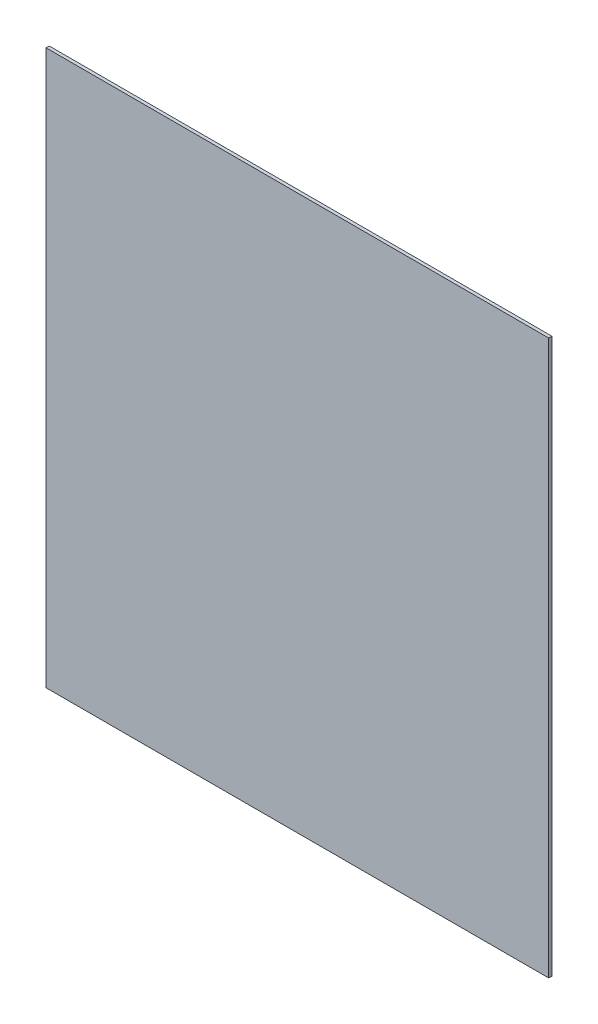
ISO-10303-21;
HEADER;
FILE_DESCRIPTION(('STEP AP214'),'2;1');
FILE_NAME('part.step','',(''),(''),'','','');
FILE_SCHEMA(('AUTOMOTIVE_DESIGN { 1 0 10303 214 1 1 1 1 }'));
ENDSEC;
DATA;
#1=APPLICATION_CONTEXT('core data for automotive mechanical design processes');
#2=APPLICATION_PROTOCOL_DEFINITION('international standard','automotive_design',2000,#1);
#3=PRODUCT_CONTEXT('',#1,'mechanical');
#4=PRODUCT('Part','Part','',(#3));
#5=PRODUCT_RELATED_PRODUCT_CATEGORY('part','',(#4));
#6=PRODUCT_DEFINITION_FORMATION('','',#4);
#7=PRODUCT_DEFINITION_CONTEXT('part definition',#1,'design');
#8=PRODUCT_DEFINITION('design','',#6,#7);
#9=PRODUCT_DEFINITION_SHAPE('','',#8);
#10=(LENGTH_UNIT() NAMED_UNIT(*) SI_UNIT(.MILLI.,.METRE.));
#11=(NAMED_UNIT(*) PLANE_ANGLE_UNIT() SI_UNIT($,.RADIAN.));
#12=(NAMED_UNIT(*) SI_UNIT($,.STERADIAN.) SOLID_ANGLE_UNIT());
#13=UNCERTAINTY_MEASURE_WITH_UNIT(LENGTH_MEASURE(1.E-05),#10,'distance_accuracy_value','');
#14=(GEOMETRIC_REPRESENTATION_CONTEXT(3) GLOBAL_UNCERTAINTY_ASSIGNED_CONTEXT((#13)) GLOBAL_UNIT_ASSIGNED_CONTEXT((#10,
#11,#12)) REPRESENTATION_CONTEXT('',''));
#15=CARTESIAN_POINT('',(0.,0.,0.));
#16=DIRECTION('',(0.,0.,1.));
#17=DIRECTION('',(1.,0.,0.));
#18=AXIS2_PLACEMENT_3D('',#15,#16,#17);
#19=CARTESIAN_POINT('',(175.410746843619,135.27313883295,-1.5));
#20=DIRECTION('',(-1.,0.,0.));
#21=DIRECTION('',(0.,0.,1.));
#22=AXIS2_PLACEMENT_3D('',#19,#20,#21);
#23=PLANE('',#22);
#24=DIRECTION('',(0.,-1.,0.));
#25=VECTOR('',#24,1.);
#26=CARTESIAN_POINT('',(175.410746843619,135.27313883295,0.));
#27=LINE('',#26,#25);
#28=CARTESIAN_POINT('',(175.410746843619,397.67354220018,0.));
#29=VERTEX_POINT('',#28);
#30=CARTESIAN_POINT('',(175.410746843619,135.27313883295,0.));
#31=VERTEX_POINT('',#30);
#32=EDGE_CURVE('E114',#29,#31,#27,.T.);
#33=ORIENTED_EDGE('',*,*,#32,.F.);
#34=DIRECTION('',(0.,0.,1.));
#35=VECTOR('',#34,1.);
#36=CARTESIAN_POINT('',(175.410746843619,397.67354220018,-1.5));
#37=LINE('',#36,#35);
#38=CARTESIAN_POINT('',(175.410746843619,397.67354220018,-1.5));
#39=VERTEX_POINT('',#38);
#40=EDGE_CURVE('E11',#39,#29,#37,.T.);
#41=ORIENTED_EDGE('',*,*,#40,.F.);
#42=DIRECTION('',(0.,-1.,0.));
#43=VECTOR('',#42,1.);
#44=CARTESIAN_POINT('',(175.410746843619,135.27313883295,-1.5));
#45=LINE('',#44,#43);
#46=CARTESIAN_POINT('',(175.410746843619,135.27313883295,-1.5));
#47=VERTEX_POINT('',#46);
#48=EDGE_CURVE('E105',#39,#47,#45,.T.);
#49=ORIENTED_EDGE('',*,*,#48,.T.);
#50=DIRECTION('',(0.,0.,1.));
#51=VECTOR('',#50,1.);
#52=CARTESIAN_POINT('',(175.410746843619,135.27313883295,-1.5));
#53=LINE('',#52,#51);
#54=EDGE_CURVE('E46',#47,#31,#53,.T.);
#55=ORIENTED_EDGE('',*,*,#54,.T.);
#56=EDGE_LOOP('',(#33,#41,#49,#55));
#57=FACE_BOUND('',#56,.T.);
#58=ADVANCED_FACE('F43',(#57),#23,.T.);
#59=CARTESIAN_POINT('',(413.371896956058,397.67354220018,-1.5));
#60=DIRECTION('',(0.,1.,0.));
#61=DIRECTION('',(0.,0.,1.));
#62=AXIS2_PLACEMENT_3D('',#59,#60,#61);
#63=PLANE('',#62);
#64=DIRECTION('',(-1.,0.,0.));
#65=VECTOR('',#64,1.);
#66=CARTESIAN_POINT('',(413.371896956058,397.67354220018,0.));
#67=LINE('',#66,#65);
#68=CARTESIAN_POINT('',(413.371896956058,397.67354220018,0.));
#69=VERTEX_POINT('',#68);
#70=EDGE_CURVE('E109',#69,#29,#67,.T.);
#71=ORIENTED_EDGE('',*,*,#70,.F.);
#72=DIRECTION('',(0.,0.,1.));
#73=VECTOR('',#72,1.);
#74=CARTESIAN_POINT('',(413.371896956058,397.67354220018,-1.5));
#75=LINE('',#74,#73);
#76=CARTESIAN_POINT('',(413.371896956058,397.67354220018,-1.5));
#77=VERTEX_POINT('',#76);
#78=EDGE_CURVE('E53',#77,#69,#75,.T.);
#79=ORIENTED_EDGE('',*,*,#78,.F.);
#80=DIRECTION('',(-1.,0.,0.));
#81=VECTOR('',#80,1.);
#82=CARTESIAN_POINT('',(413.371896956058,397.67354220018,-1.5));
#83=LINE('',#82,#81);
#84=EDGE_CURVE('E100',#77,#39,#83,.T.);
#85=ORIENTED_EDGE('',*,*,#84,.T.);
#86=ORIENTED_EDGE('',*,*,#40,.T.);
#87=EDGE_LOOP('',(#71,#79,#85,#86));
#88=FACE_BOUND('',#87,.T.);
#89=ADVANCED_FACE('F136',(#88),#63,.T.);
#90=CARTESIAN_POINT('',(413.371896956058,135.27313883295,-1.5));
#91=DIRECTION('',(1.,0.,0.));
#92=DIRECTION('',(0.,0.,-1.));
#93=AXIS2_PLACEMENT_3D('',#90,#91,#92);
#94=PLANE('',#93);
#95=DIRECTION('',(0.,1.,0.));
#96=VECTOR('',#95,1.);
#97=CARTESIAN_POINT('',(413.371896956058,135.27313883295,0.));
#98=LINE('',#97,#96);
#99=CARTESIAN_POINT('',(413.371896956058,135.27313883295,0.));
#100=VERTEX_POINT('',#99);
#101=EDGE_CURVE('E94',#100,#69,#98,.T.);
#102=ORIENTED_EDGE('',*,*,#101,.F.);
#103=DIRECTION('',(0.,0.,1.));
#104=VECTOR('',#103,1.);
#105=CARTESIAN_POINT('',(413.371896956058,135.27313883295,-1.5));
#106=LINE('',#105,#104);
#107=CARTESIAN_POINT('',(413.371896956058,135.27313883295,-1.5));
#108=VERTEX_POINT('',#107);
#109=EDGE_CURVE('E89',#108,#100,#106,.T.);
#110=ORIENTED_EDGE('',*,*,#109,.F.);
#111=DIRECTION('',(0.,1.,0.));
#112=VECTOR('',#111,1.);
#113=CARTESIAN_POINT('',(413.371896956058,135.27313883295,-1.5));
#114=LINE('',#113,#112);
#115=EDGE_CURVE('E92',#108,#77,#114,.T.);
#116=ORIENTED_EDGE('',*,*,#115,.T.);
#117=ORIENTED_EDGE('',*,*,#78,.T.);
#118=EDGE_LOOP('',(#102,#110,#116,#117));
#119=FACE_BOUND('',#118,.T.);
#120=ADVANCED_FACE('F91',(#119),#94,.T.);
#121=CARTESIAN_POINT('',(413.371896956058,135.27313883295,-1.5));
#122=DIRECTION('',(0.,-1.,0.));
#123=DIRECTION('',(0.,0.,-1.));
#124=AXIS2_PLACEMENT_3D('',#121,#122,#123);
#125=PLANE('',#124);
#126=DIRECTION('',(1.,0.,0.));
#127=VECTOR('',#126,1.);
#128=CARTESIAN_POINT('',(413.371896956058,135.27313883295,0.));
#129=LINE('',#128,#127);
#130=EDGE_CURVE('E118',#31,#100,#129,.T.);
#131=ORIENTED_EDGE('',*,*,#130,.F.);
#132=ORIENTED_EDGE('',*,*,#54,.F.);
#133=DIRECTION('',(1.,0.,0.));
#134=VECTOR('',#133,1.);
#135=CARTESIAN_POINT('',(413.371896956058,135.27313883295,-1.5));
#136=LINE('',#135,#134);
#137=EDGE_CURVE('E99',#47,#108,#136,.T.);
#138=ORIENTED_EDGE('',*,*,#137,.T.);
#139=ORIENTED_EDGE('',*,*,#109,.T.);
#140=EDGE_LOOP('',(#131,#132,#138,#139));
#141=FACE_BOUND('',#140,.T.);
#142=ADVANCED_FACE('F103',(#141),#125,.T.);
#143=CARTESIAN_POINT('',(0.,0.,-1.5));
#144=DIRECTION('',(0.,0.,1.));
#145=DIRECTION('',(1.,0.,0.));
#146=AXIS2_PLACEMENT_3D('',#143,#144,#145);
#147=PLANE('',#146);
#148=ORIENTED_EDGE('',*,*,#48,.F.);
#149=ORIENTED_EDGE('',*,*,#84,.F.);
#150=ORIENTED_EDGE('',*,*,#115,.F.);
#151=ORIENTED_EDGE('',*,*,#137,.F.);
#152=EDGE_LOOP('',(#148,#149,#150,#151));
#153=FACE_BOUND('',#152,.T.);
#154=ADVANCED_FACE('F98',(#153),#147,.F.);
#155=CARTESIAN_POINT('',(0.,0.,0.));
#156=DIRECTION('',(0.,0.,1.));
#157=DIRECTION('',(1.,0.,0.));
#158=AXIS2_PLACEMENT_3D('',#155,#156,#157);
#159=PLANE('',#158);
#160=ORIENTED_EDGE('',*,*,#32,.T.);
#161=ORIENTED_EDGE('',*,*,#130,.T.);
#162=ORIENTED_EDGE('',*,*,#101,.T.);
#163=ORIENTED_EDGE('',*,*,#70,.T.);
#164=EDGE_LOOP('',(#160,#161,#162,#163));
#165=FACE_BOUND('',#164,.T.);
#166=ADVANCED_FACE('F135',(#165),#159,.T.);
#167=CLOSED_SHELL('',(#58,#89,#120,#142,#154,#166));
#168=MANIFOLD_SOLID_BREP('B2',#167);
#169=ADVANCED_BREP_SHAPE_REPRESENTATION('',(#18,#168),#14);
#170=SHAPE_DEFINITION_REPRESENTATION(#9,#169);
ENDSEC;
END-ISO-10303-21;
